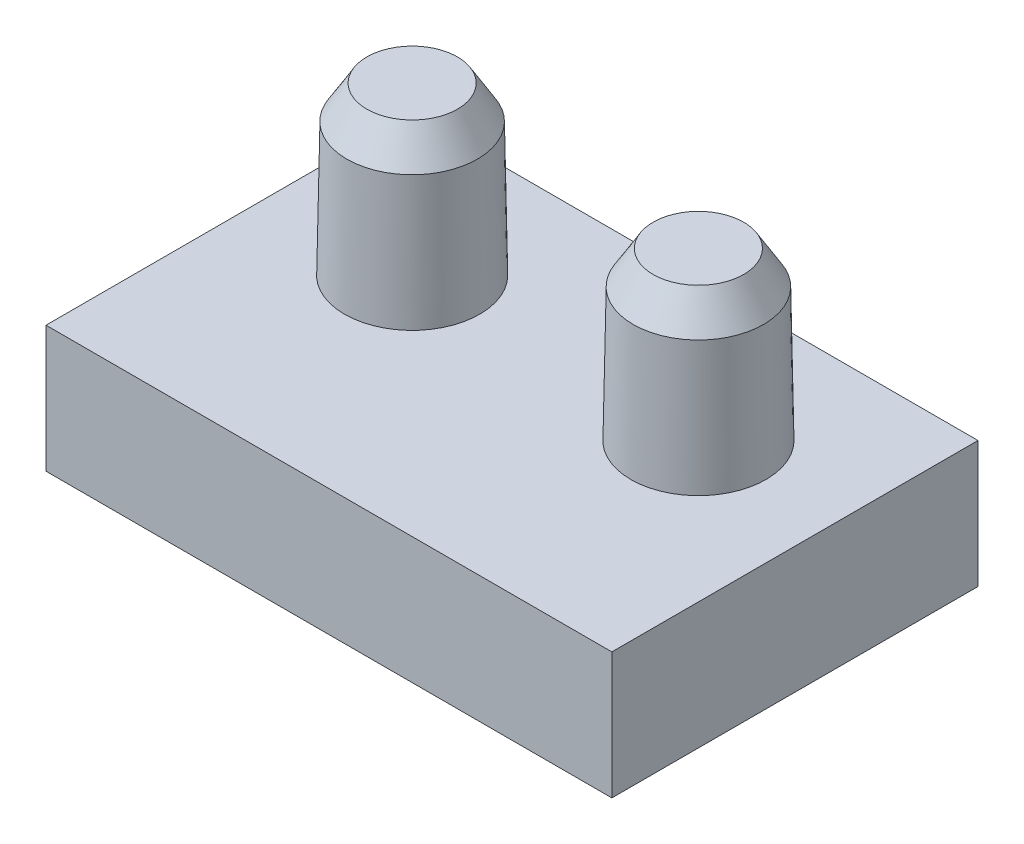
ISO-10303-21;
HEADER;
FILE_DESCRIPTION(('STEP AP214'),'2;1');
FILE_NAME('part.step','',(''),(''),'','','');
FILE_SCHEMA(('AUTOMOTIVE_DESIGN { 1 0 10303 214 1 1 1 1 }'));
ENDSEC;
DATA;
#1=APPLICATION_CONTEXT('core data for automotive mechanical design processes');
#2=APPLICATION_PROTOCOL_DEFINITION('international standard','automotive_design',2000,#1);
#3=PRODUCT_CONTEXT('',#1,'mechanical');
#4=PRODUCT('Part','Part','',(#3));
#5=PRODUCT_RELATED_PRODUCT_CATEGORY('part','',(#4));
#6=PRODUCT_DEFINITION_FORMATION('','',#4);
#7=PRODUCT_DEFINITION_CONTEXT('part definition',#1,'design');
#8=PRODUCT_DEFINITION('design','',#6,#7);
#9=PRODUCT_DEFINITION_SHAPE('','',#8);
#10=(LENGTH_UNIT() NAMED_UNIT(*) SI_UNIT(.MILLI.,.METRE.));
#11=(NAMED_UNIT(*) PLANE_ANGLE_UNIT() SI_UNIT($,.RADIAN.));
#12=(NAMED_UNIT(*) SI_UNIT($,.STERADIAN.) SOLID_ANGLE_UNIT());
#13=UNCERTAINTY_MEASURE_WITH_UNIT(LENGTH_MEASURE(1.E-05),#10,'distance_accuracy_value','');
#14=(GEOMETRIC_REPRESENTATION_CONTEXT(3) GLOBAL_UNCERTAINTY_ASSIGNED_CONTEXT((#13)) GLOBAL_UNIT_ASSIGNED_CONTEXT((#10,
#11,#12)) REPRESENTATION_CONTEXT('',''));
#15=CARTESIAN_POINT('',(0.,0.,0.));
#16=DIRECTION('',(0.,0.,1.));
#17=DIRECTION('',(1.,0.,0.));
#18=AXIS2_PLACEMENT_3D('',#15,#16,#17);
#19=CARTESIAN_POINT('',(-4.25,1.9,-2.75));
#20=DIRECTION('',(1.,0.,0.));
#21=DIRECTION('',(0.,0.,-1.));
#22=AXIS2_PLACEMENT_3D('',#19,#20,#21);
#23=PLANE('',#22);
#24=DIRECTION('',(0.,0.,1.));
#25=VECTOR('',#24,1.);
#26=CARTESIAN_POINT('',(-4.25,0.,-2.75));
#27=LINE('',#26,#25);
#28=CARTESIAN_POINT('',(-4.25,0.,-2.75));
#29=VERTEX_POINT('',#28);
#30=CARTESIAN_POINT('',(-4.25,0.,2.75));
#31=VERTEX_POINT('',#30);
#32=EDGE_CURVE('E139',#29,#31,#27,.T.);
#33=ORIENTED_EDGE('',*,*,#32,.T.);
#34=DIRECTION('',(0.,-1.,0.));
#35=VECTOR('',#34,1.);
#36=CARTESIAN_POINT('',(-4.25,1.9,2.75));
#37=LINE('',#36,#35);
#38=CARTESIAN_POINT('',(-4.25,1.9,2.75));
#39=VERTEX_POINT('',#38);
#40=EDGE_CURVE('E126',#39,#31,#37,.T.);
#41=ORIENTED_EDGE('',*,*,#40,.F.);
#42=DIRECTION('',(0.,0.,1.));
#43=VECTOR('',#42,1.);
#44=CARTESIAN_POINT('',(-4.25,1.9,-2.75));
#45=LINE('',#44,#43);
#46=CARTESIAN_POINT('',(-4.25,1.9,-2.75));
#47=VERTEX_POINT('',#46);
#48=EDGE_CURVE('E118',#47,#39,#45,.T.);
#49=ORIENTED_EDGE('',*,*,#48,.F.);
#50=DIRECTION('',(0.,-1.,0.));
#51=VECTOR('',#50,1.);
#52=CARTESIAN_POINT('',(-4.25,1.9,-2.75));
#53=LINE('',#52,#51);
#54=EDGE_CURVE('E135',#47,#29,#53,.T.);
#55=ORIENTED_EDGE('',*,*,#54,.T.);
#56=EDGE_LOOP('',(#33,#41,#49,#55));
#57=FACE_BOUND('',#56,.T.);
#58=ADVANCED_FACE('F56',(#57),#23,.F.);
#59=CARTESIAN_POINT('',(-4.25,1.9,2.75));
#60=DIRECTION('',(0.,0.,-1.));
#61=DIRECTION('',(-1.,0.,0.));
#62=AXIS2_PLACEMENT_3D('',#59,#60,#61);
#63=PLANE('',#62);
#64=DIRECTION('',(1.,0.,0.));
#65=VECTOR('',#64,1.);
#66=CARTESIAN_POINT('',(-4.25,0.,2.75));
#67=LINE('',#66,#65);
#68=CARTESIAN_POINT('',(4.25,0.,2.75));
#69=VERTEX_POINT('',#68);
#70=EDGE_CURVE('E124',#31,#69,#67,.T.);
#71=ORIENTED_EDGE('',*,*,#70,.T.);
#72=DIRECTION('',(0.,-1.,0.));
#73=VECTOR('',#72,1.);
#74=CARTESIAN_POINT('',(4.25,1.9,2.75));
#75=LINE('',#74,#73);
#76=CARTESIAN_POINT('',(4.25,1.9,2.75));
#77=VERTEX_POINT('',#76);
#78=EDGE_CURVE('E122',#77,#69,#75,.T.);
#79=ORIENTED_EDGE('',*,*,#78,.F.);
#80=DIRECTION('',(1.,0.,0.));
#81=VECTOR('',#80,1.);
#82=CARTESIAN_POINT('',(-4.25,1.9,2.75));
#83=LINE('',#82,#81);
#84=EDGE_CURVE('E113',#39,#77,#83,.T.);
#85=ORIENTED_EDGE('',*,*,#84,.F.);
#86=ORIENTED_EDGE('',*,*,#40,.T.);
#87=EDGE_LOOP('',(#71,#79,#85,#86));
#88=FACE_BOUND('',#87,.T.);
#89=ADVANCED_FACE('F123',(#88),#63,.F.);
#90=CARTESIAN_POINT('',(4.25,1.9,-2.75));
#91=DIRECTION('',(-1.,0.,0.));
#92=DIRECTION('',(0.,0.,1.));
#93=AXIS2_PLACEMENT_3D('',#90,#91,#92);
#94=PLANE('',#93);
#95=DIRECTION('',(0.,0.,-1.));
#96=VECTOR('',#95,1.);
#97=CARTESIAN_POINT('',(4.25,0.,-2.75));
#98=LINE('',#97,#96);
#99=CARTESIAN_POINT('',(4.25,0.,-2.75));
#100=VERTEX_POINT('',#99);
#101=EDGE_CURVE('E97',#69,#100,#98,.T.);
#102=ORIENTED_EDGE('',*,*,#101,.T.);
#103=DIRECTION('',(0.,-1.,0.));
#104=VECTOR('',#103,1.);
#105=CARTESIAN_POINT('',(4.25,1.9,-2.75));
#106=LINE('',#105,#104);
#107=CARTESIAN_POINT('',(4.25,1.9,-2.75));
#108=VERTEX_POINT('',#107);
#109=EDGE_CURVE('E127',#108,#100,#106,.T.);
#110=ORIENTED_EDGE('',*,*,#109,.F.);
#111=DIRECTION('',(0.,0.,-1.));
#112=VECTOR('',#111,1.);
#113=CARTESIAN_POINT('',(4.25,1.9,-2.75));
#114=LINE('',#113,#112);
#115=EDGE_CURVE('E116',#77,#108,#114,.T.);
#116=ORIENTED_EDGE('',*,*,#115,.F.);
#117=ORIENTED_EDGE('',*,*,#78,.T.);
#118=EDGE_LOOP('',(#102,#110,#116,#117));
#119=FACE_BOUND('',#118,.T.);
#120=ADVANCED_FACE('F129',(#119),#94,.F.);
#121=CARTESIAN_POINT('',(-4.25,1.9,-2.75));
#122=DIRECTION('',(0.,0.,1.));
#123=DIRECTION('',(1.,0.,0.));
#124=AXIS2_PLACEMENT_3D('',#121,#122,#123);
#125=PLANE('',#124);
#126=DIRECTION('',(-1.,0.,0.));
#127=VECTOR('',#126,1.);
#128=CARTESIAN_POINT('',(-4.25,0.,-2.75));
#129=LINE('',#128,#127);
#130=EDGE_CURVE('E103',#100,#29,#129,.T.);
#131=ORIENTED_EDGE('',*,*,#130,.T.);
#132=ORIENTED_EDGE('',*,*,#54,.F.);
#133=DIRECTION('',(-1.,0.,0.));
#134=VECTOR('',#133,1.);
#135=CARTESIAN_POINT('',(-4.25,1.9,-2.75));
#136=LINE('',#135,#134);
#137=EDGE_CURVE('E77',#108,#47,#136,.T.);
#138=ORIENTED_EDGE('',*,*,#137,.F.);
#139=ORIENTED_EDGE('',*,*,#109,.T.);
#140=EDGE_LOOP('',(#131,#132,#138,#139));
#141=FACE_BOUND('',#140,.T.);
#142=ADVANCED_FACE('F193',(#141),#125,.F.);
#143=CARTESIAN_POINT('',(0.,1.9,0.));
#144=DIRECTION('',(0.,1.,0.));
#145=DIRECTION('',(0.,0.,1.));
#146=AXIS2_PLACEMENT_3D('',#143,#144,#145);
#147=PLANE('',#146);
#148=CARTESIAN_POINT('',(2.15,1.9,-0.650000000000001));
#149=DIRECTION('',(0.,1.,0.));
#150=DIRECTION('',(0.,0.,1.));
#151=AXIS2_PLACEMENT_3D('',#148,#149,#150);
#152=CIRCLE('',#151,1.0157095584354);
#153=CARTESIAN_POINT('',(2.15,1.9,0.365709558435395));
#154=VERTEX_POINT('',#153);
#155=EDGE_CURVE('E158',#154,#154,#152,.T.);
#156=ORIENTED_EDGE('',*,*,#155,.F.);
#157=EDGE_LOOP('',(#156));
#158=FACE_BOUND('',#157,.T.);
#159=CARTESIAN_POINT('',(-2.15,1.9,-0.65));
#160=DIRECTION('',(0.,1.,0.));
#161=DIRECTION('',(0.,0.,1.));
#162=AXIS2_PLACEMENT_3D('',#159,#160,#161);
#163=CIRCLE('',#162,1.0157095584354);
#164=CARTESIAN_POINT('',(-2.15,1.9,0.365709558435396));
#165=VERTEX_POINT('',#164);
#166=EDGE_CURVE('E154',#165,#165,#163,.T.);
#167=ORIENTED_EDGE('',*,*,#166,.F.);
#168=EDGE_LOOP('',(#167));
#169=FACE_BOUND('',#168,.T.);
#170=ORIENTED_EDGE('',*,*,#48,.T.);
#171=ORIENTED_EDGE('',*,*,#84,.T.);
#172=ORIENTED_EDGE('',*,*,#115,.T.);
#173=ORIENTED_EDGE('',*,*,#137,.T.);
#174=EDGE_LOOP('',(#170,#171,#172,#173));
#175=FACE_BOUND('',#174,.T.);
#176=ADVANCED_FACE('F114',(#158,#169,#175),#147,.T.);
#177=CARTESIAN_POINT('',(0.,0.,0.));
#178=DIRECTION('',(0.,1.,0.));
#179=DIRECTION('',(0.,0.,1.));
#180=AXIS2_PLACEMENT_3D('',#177,#178,#179);
#181=PLANE('',#180);
#182=ORIENTED_EDGE('',*,*,#32,.F.);
#183=ORIENTED_EDGE('',*,*,#130,.F.);
#184=ORIENTED_EDGE('',*,*,#101,.F.);
#185=ORIENTED_EDGE('',*,*,#70,.F.);
#186=EDGE_LOOP('',(#182,#183,#184,#185));
#187=FACE_BOUND('',#186,.T.);
#188=ADVANCED_FACE('F196',(#187),#181,.F.);
#189=CARTESIAN_POINT('',(-2.15,2.8,-0.65));
#190=DIRECTION('',(0.,-1.,0.));
#191=DIRECTION('',(0.,0.,1.));
#192=AXIS2_PLACEMENT_3D('',#189,#190,#191);
#193=CONICAL_SURFACE('',#192,1.,0.0174532925199433);
#194=CARTESIAN_POINT('',(-2.15,3.9000761524218,-0.65));
#195=DIRECTION('',(0.,1.,0.));
#196=DIRECTION('',(0.,0.,1.));
#197=AXIS2_PLACEMENT_3D('',#194,#195,#196);
#198=CIRCLE('',#197,0.980798099333494);
#199=CARTESIAN_POINT('',(-2.15,3.9000761524218,0.330798099333493));
#200=VERTEX_POINT('',#199);
#201=EDGE_CURVE('E14',#200,#200,#198,.F.);
#202=ORIENTED_EDGE('',*,*,#201,.T.);
#203=EDGE_LOOP('',(#202));
#204=FACE_BOUND('',#203,.T.);
#205=ORIENTED_EDGE('',*,*,#166,.T.);
#206=EDGE_LOOP('',(#205));
#207=FACE_BOUND('',#206,.T.);
#208=ADVANCED_FACE('F199',(#204,#207),#193,.T.);
#209=CARTESIAN_POINT('',(2.15,2.8,-0.650000000000001));
#210=DIRECTION('',(0.,-1.,0.));
#211=DIRECTION('',(0.,0.,1.));
#212=AXIS2_PLACEMENT_3D('',#209,#210,#211);
#213=CONICAL_SURFACE('',#212,1.,0.0174532925199433);
#214=CARTESIAN_POINT('',(2.15,3.9000761524218,-0.650000000000001));
#215=DIRECTION('',(0.,1.,0.));
#216=DIRECTION('',(0.,0.,1.));
#217=AXIS2_PLACEMENT_3D('',#214,#215,#216);
#218=CIRCLE('',#217,0.980798099333494);
#219=CARTESIAN_POINT('',(2.15,3.9000761524218,0.330798099333493));
#220=VERTEX_POINT('',#219);
#221=EDGE_CURVE('E165',#220,#220,#218,.F.);
#222=ORIENTED_EDGE('',*,*,#221,.T.);
#223=EDGE_LOOP('',(#222));
#224=FACE_BOUND('',#223,.T.);
#225=ORIENTED_EDGE('',*,*,#155,.T.);
#226=EDGE_LOOP('',(#225));
#227=FACE_BOUND('',#226,.T.);
#228=ADVANCED_FACE('F206',(#224,#227),#213,.T.);
#229=CARTESIAN_POINT('',(0.,4.4,0.));
#230=DIRECTION('',(0.,1.,0.));
#231=DIRECTION('',(0.,0.,1.));
#232=AXIS2_PLACEMENT_3D('',#229,#230,#231);
#233=PLANE('',#232);
#234=CARTESIAN_POINT('',(-2.15,4.4,-0.65));
#235=DIRECTION('',(0.,1.,0.));
#236=DIRECTION('',(0.,0.,1.));
#237=AXIS2_PLACEMENT_3D('',#234,#235,#236);
#238=CIRCLE('',#237,0.680413546811019);
#239=CARTESIAN_POINT('',(-2.15,4.4,0.0304135468110186));
#240=VERTEX_POINT('',#239);
#241=EDGE_CURVE('E66',#240,#240,#238,.T.);
#242=ORIENTED_EDGE('',*,*,#241,.T.);
#243=EDGE_LOOP('',(#242));
#244=FACE_BOUND('',#243,.T.);
#245=ADVANCED_FACE('F172',(#244),#233,.T.);
#246=CARTESIAN_POINT('',(0.,4.4,0.));
#247=DIRECTION('',(0.,1.,0.));
#248=DIRECTION('',(0.,0.,1.));
#249=AXIS2_PLACEMENT_3D('',#246,#247,#248);
#250=PLANE('',#249);
#251=CARTESIAN_POINT('',(2.15,4.4,-0.650000000000001));
#252=DIRECTION('',(0.,1.,0.));
#253=DIRECTION('',(0.,0.,1.));
#254=AXIS2_PLACEMENT_3D('',#251,#252,#253);
#255=CIRCLE('',#254,0.680413546811019);
#256=CARTESIAN_POINT('',(2.15,4.4,0.0304135468110184));
#257=VERTEX_POINT('',#256);
#258=EDGE_CURVE('E161',#257,#257,#255,.T.);
#259=ORIENTED_EDGE('',*,*,#258,.T.);
#260=EDGE_LOOP('',(#259));
#261=FACE_BOUND('',#260,.T.);
#262=ADVANCED_FACE('F180',(#261),#250,.T.);
#263=CARTESIAN_POINT('',(2.15,4.4,-0.650000000000001));
#264=DIRECTION('',(0.,-1.,0.));
#265=DIRECTION('',(0.,0.,-1.));
#266=AXIS2_PLACEMENT_3D('',#263,#264,#265);
#267=CONICAL_SURFACE('',#266,0.680413546811019,0.541052068118241);
#268=ORIENTED_EDGE('',*,*,#221,.F.);
#269=EDGE_LOOP('',(#268));
#270=FACE_BOUND('',#269,.T.);
#271=ORIENTED_EDGE('',*,*,#258,.F.);
#272=EDGE_LOOP('',(#271));
#273=FACE_BOUND('',#272,.T.);
#274=ADVANCED_FACE('F175',(#270,#273),#267,.T.);
#275=CARTESIAN_POINT('',(-2.15,4.4,-0.65));
#276=DIRECTION('',(0.,-1.,0.));
#277=DIRECTION('',(0.,0.,-1.));
#278=AXIS2_PLACEMENT_3D('',#275,#276,#277);
#279=CONICAL_SURFACE('',#278,0.680413546811019,0.541052068118241);
#280=ORIENTED_EDGE('',*,*,#201,.F.);
#281=EDGE_LOOP('',(#280));
#282=FACE_BOUND('',#281,.T.);
#283=ORIENTED_EDGE('',*,*,#241,.F.);
#284=EDGE_LOOP('',(#283));
#285=FACE_BOUND('',#284,.T.);
#286=ADVANCED_FACE('F58',(#282,#285),#279,.T.);
#287=CLOSED_SHELL('',(#58,#89,#120,#142,#176,#188,#208,#228,#245,#262,#274,#286));
#288=MANIFOLD_SOLID_BREP('B2',#287);
#289=ADVANCED_BREP_SHAPE_REPRESENTATION('',(#18,#288),#14);
#290=SHAPE_DEFINITION_REPRESENTATION(#9,#289);
ENDSEC;
END-ISO-10303-21;
